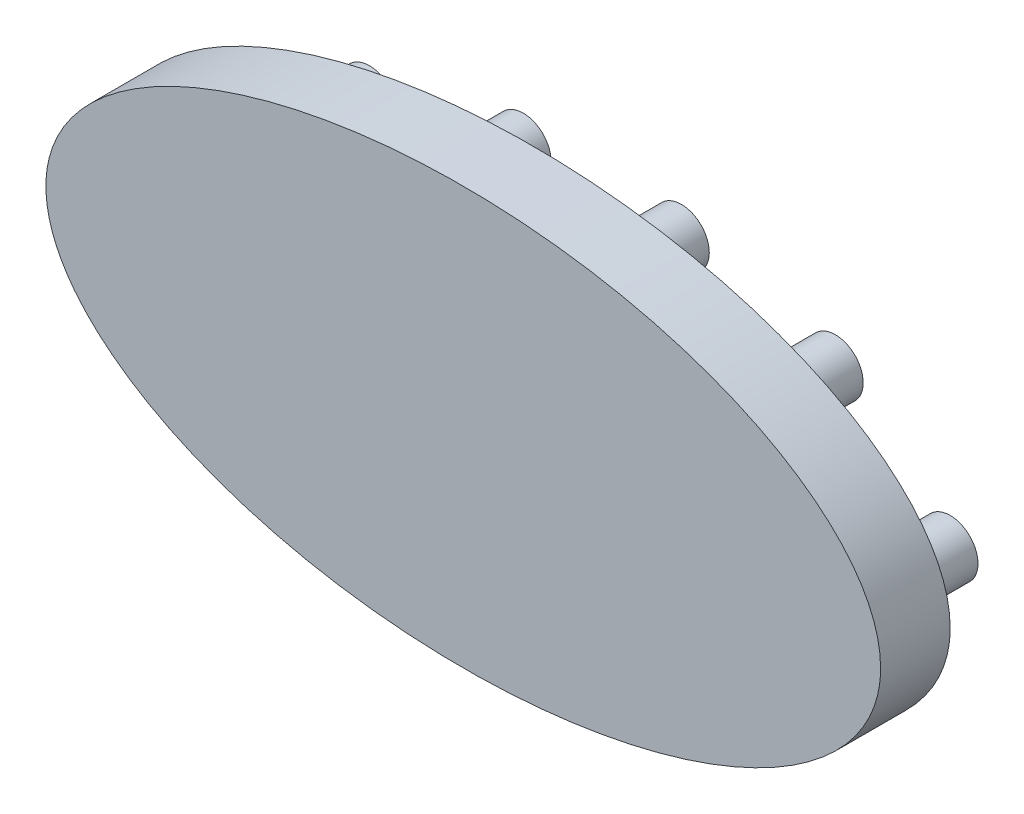
ISO-10303-21;
HEADER;
FILE_DESCRIPTION(('STEP AP214'),'2;1');
FILE_NAME('part.step','',(''),(''),'','','');
FILE_SCHEMA(('AUTOMOTIVE_DESIGN { 1 0 10303 214 1 1 1 1 }'));
ENDSEC;
DATA;
#1=APPLICATION_CONTEXT('core data for automotive mechanical design processes');
#2=APPLICATION_PROTOCOL_DEFINITION('international standard','automotive_design',2000,#1);
#3=PRODUCT_CONTEXT('',#1,'mechanical');
#4=PRODUCT('Part','Part','',(#3));
#5=PRODUCT_RELATED_PRODUCT_CATEGORY('part','',(#4));
#6=PRODUCT_DEFINITION_FORMATION('','',#4);
#7=PRODUCT_DEFINITION_CONTEXT('part definition',#1,'design');
#8=PRODUCT_DEFINITION('design','',#6,#7);
#9=PRODUCT_DEFINITION_SHAPE('','',#8);
#10=(LENGTH_UNIT() NAMED_UNIT(*) SI_UNIT(.MILLI.,.METRE.));
#11=(NAMED_UNIT(*) PLANE_ANGLE_UNIT() SI_UNIT($,.RADIAN.));
#12=(NAMED_UNIT(*) SI_UNIT($,.STERADIAN.) SOLID_ANGLE_UNIT());
#13=UNCERTAINTY_MEASURE_WITH_UNIT(LENGTH_MEASURE(1.E-05),#10,'distance_accuracy_value','');
#14=(GEOMETRIC_REPRESENTATION_CONTEXT(3) GLOBAL_UNCERTAINTY_ASSIGNED_CONTEXT((#13)) GLOBAL_UNIT_ASSIGNED_CONTEXT((#10,
#11,#12)) REPRESENTATION_CONTEXT('',''));
#15=CARTESIAN_POINT('',(0.,0.,0.));
#16=DIRECTION('',(0.,0.,1.));
#17=DIRECTION('',(1.,0.,0.));
#18=AXIS2_PLACEMENT_3D('',#15,#16,#17);
#19=CARTESIAN_POINT('',(0.,0.,10.));
#20=DIRECTION('',(0.,0.,1.));
#21=DIRECTION('',(1.,0.,0.));
#22=AXIS2_PLACEMENT_3D('',#19,#20,#21);
#23=ELLIPSE('',#22,60.,30.);
#24=DIRECTION('',(0.,0.,-1.));
#25=VECTOR('',#24,1.);
#26=SURFACE_OF_LINEAR_EXTRUSION('',#23,#25);
#27=CARTESIAN_POINT('',(60.,0.,10.));
#28=VERTEX_POINT('',#27);
#29=EDGE_CURVE('E10',#28,#28,#23,.T.);
#30=ORIENTED_EDGE('',*,*,#29,.F.);
#31=EDGE_LOOP('',(#30));
#32=FACE_BOUND('',#31,.T.);
#33=CARTESIAN_POINT('',(0.,0.,0.));
#34=DIRECTION('',(0.,0.,1.));
#35=DIRECTION('',(1.,0.,0.));
#36=AXIS2_PLACEMENT_3D('',#33,#34,#35);
#37=ELLIPSE('',#36,60.,30.);
#38=CARTESIAN_POINT('',(60.,0.,0.));
#39=VERTEX_POINT('',#38);
#40=EDGE_CURVE('E37',#39,#39,#37,.T.);
#41=ORIENTED_EDGE('',*,*,#40,.T.);
#42=EDGE_LOOP('',(#41));
#43=FACE_BOUND('',#42,.T.);
#44=ADVANCED_FACE('F33',(#32,#43),#26,.F.);
#45=CARTESIAN_POINT('',(0.,0.,10.));
#46=DIRECTION('',(0.,0.,1.));
#47=DIRECTION('',(1.,0.,0.));
#48=AXIS2_PLACEMENT_3D('',#45,#46,#47);
#49=PLANE('',#48);
#50=ORIENTED_EDGE('',*,*,#29,.T.);
#51=EDGE_LOOP('',(#50));
#52=FACE_BOUND('',#51,.T.);
#53=ADVANCED_FACE('F118',(#52),#49,.T.);
#54=CARTESIAN_POINT('',(0.,0.,0.));
#55=DIRECTION('',(0.,0.,1.));
#56=DIRECTION('',(1.,0.,0.));
#57=AXIS2_PLACEMENT_3D('',#54,#55,#56);
#58=PLANE('',#57);
#59=CARTESIAN_POINT('',(-33.4927376913771,-14.2505559737356,0.));
#60=DIRECTION('',(0.,0.,1.));
#61=DIRECTION('',(1.,0.,0.));
#62=AXIS2_PLACEMENT_3D('',#59,#60,#61);
#63=CIRCLE('',#62,4.00000000000001);
#64=CARTESIAN_POINT('',(-29.4927376913771,-14.2505559737356,0.));
#65=VERTEX_POINT('',#64);
#66=EDGE_CURVE('E100',#65,#65,#63,.T.);
#67=ORIENTED_EDGE('',*,*,#66,.T.);
#68=EDGE_LOOP('',(#67));
#69=FACE_BOUND('',#68,.T.);
#70=CARTESIAN_POINT('',(-11.3707510585485,-19.4054964723432,0.));
#71=DIRECTION('',(0.,0.,1.));
#72=DIRECTION('',(1.,0.,0.));
#73=AXIS2_PLACEMENT_3D('',#70,#71,#72);
#74=CIRCLE('',#73,4.00000000000001);
#75=CARTESIAN_POINT('',(-7.37075105854853,-19.4054964723432,0.));
#76=VERTEX_POINT('',#75);
#77=EDGE_CURVE('E94',#76,#76,#74,.T.);
#78=ORIENTED_EDGE('',*,*,#77,.T.);
#79=EDGE_LOOP('',(#78));
#80=FACE_BOUND('',#79,.T.);
#81=CARTESIAN_POINT('',(11.3694778656819,-19.4056340544413,0.));
#82=DIRECTION('',(0.,0.,1.));
#83=DIRECTION('',(1.,0.,0.));
#84=AXIS2_PLACEMENT_3D('',#81,#82,#83);
#85=CIRCLE('',#84,4.00000000000001);
#86=CARTESIAN_POINT('',(15.3694778656819,-19.4056340544413,0.));
#87=VERTEX_POINT('',#86);
#88=EDGE_CURVE('E88',#87,#87,#85,.T.);
#89=ORIENTED_EDGE('',*,*,#88,.T.);
#90=EDGE_LOOP('',(#89));
#91=FACE_BOUND('',#90,.T.);
#92=CARTESIAN_POINT('',(33.4930624288127,-14.2504076731819,0.));
#93=DIRECTION('',(0.,0.,1.));
#94=DIRECTION('',(1.,0.,0.));
#95=AXIS2_PLACEMENT_3D('',#92,#93,#94);
#96=CIRCLE('',#95,4.00000000000001);
#97=CARTESIAN_POINT('',(37.4930624288127,-14.2504076731819,0.));
#98=VERTEX_POINT('',#97);
#99=EDGE_CURVE('E82',#98,#98,#96,.T.);
#100=ORIENTED_EDGE('',*,*,#99,.T.);
#101=EDGE_LOOP('',(#100));
#102=FACE_BOUND('',#101,.T.);
#103=CARTESIAN_POINT('',(49.9998278346197,-8.01509218299913E-05,0.));
#104=DIRECTION('',(0.,0.,1.));
#105=DIRECTION('',(1.,0.,0.));
#106=AXIS2_PLACEMENT_3D('',#103,#104,#105);
#107=CIRCLE('',#106,4.00000000000001);
#108=CARTESIAN_POINT('',(53.9998278346197,-8.01509218299913E-05,0.));
#109=VERTEX_POINT('',#108);
#110=EDGE_CURVE('E76',#109,#109,#107,.T.);
#111=ORIENTED_EDGE('',*,*,#110,.T.);
#112=EDGE_LOOP('',(#111));
#113=FACE_BOUND('',#112,.T.);
#114=CARTESIAN_POINT('',(33.4933729430165,14.2504031084241,0.));
#115=DIRECTION('',(0.,0.,1.));
#116=DIRECTION('',(1.,0.,0.));
#117=AXIS2_PLACEMENT_3D('',#114,#115,#116);
#118=CIRCLE('',#117,4.00000000000001);
#119=CARTESIAN_POINT('',(37.4933729430165,14.2504031084241,0.));
#120=VERTEX_POINT('',#119);
#121=EDGE_CURVE('E70',#120,#120,#118,.T.);
#122=ORIENTED_EDGE('',*,*,#121,.T.);
#123=EDGE_LOOP('',(#122));
#124=FACE_BOUND('',#123,.T.);
#125=CARTESIAN_POINT('',(11.3704332672726,19.4055249455261,0.));
#126=DIRECTION('',(0.,0.,1.));
#127=DIRECTION('',(1.,0.,0.));
#128=AXIS2_PLACEMENT_3D('',#125,#126,#127);
#129=CIRCLE('',#128,4.00000000000001);
#130=CARTESIAN_POINT('',(15.3704332672726,19.4055249455261,0.));
#131=VERTEX_POINT('',#130);
#132=EDGE_CURVE('E64',#131,#131,#129,.T.);
#133=ORIENTED_EDGE('',*,*,#132,.T.);
#134=EDGE_LOOP('',(#133));
#135=FACE_BOUND('',#134,.T.);
#136=CARTESIAN_POINT('',(-11.3709220577197,19.4054787370214,0.));
#137=DIRECTION('',(0.,0.,1.));
#138=DIRECTION('',(1.,0.,0.));
#139=AXIS2_PLACEMENT_3D('',#136,#137,#138);
#140=CIRCLE('',#139,4.00000000000001);
#141=CARTESIAN_POINT('',(-7.37092205771973,19.4054787370214,0.));
#142=VERTEX_POINT('',#141);
#143=EDGE_CURVE('E58',#142,#142,#140,.T.);
#144=ORIENTED_EDGE('',*,*,#143,.T.);
#145=EDGE_LOOP('',(#144));
#146=FACE_BOUND('',#145,.T.);
#147=CARTESIAN_POINT('',(-33.4928390229977,14.2505418810529,0.));
#148=DIRECTION('',(0.,0.,1.));
#149=DIRECTION('',(1.,0.,0.));
#150=AXIS2_PLACEMENT_3D('',#147,#148,#149);
#151=CIRCLE('',#150,4.00000000000001);
#152=CARTESIAN_POINT('',(-29.4928390229977,14.2505418810529,0.));
#153=VERTEX_POINT('',#152);
#154=EDGE_CURVE('E52',#153,#153,#151,.T.);
#155=ORIENTED_EDGE('',*,*,#154,.T.);
#156=EDGE_LOOP('',(#155));
#157=FACE_BOUND('',#156,.T.);
#158=CARTESIAN_POINT('',(-50.,0.,0.));
#159=DIRECTION('',(0.,0.,1.));
#160=DIRECTION('',(1.,0.,0.));
#161=AXIS2_PLACEMENT_3D('',#158,#159,#160);
#162=CIRCLE('',#161,4.00000000000001);
#163=CARTESIAN_POINT('',(-46.,0.,0.));
#164=VERTEX_POINT('',#163);
#165=EDGE_CURVE('E46',#164,#164,#162,.T.);
#166=ORIENTED_EDGE('',*,*,#165,.T.);
#167=EDGE_LOOP('',(#166));
#168=FACE_BOUND('',#167,.T.);
#169=ORIENTED_EDGE('',*,*,#40,.F.);
#170=EDGE_LOOP('',(#169));
#171=FACE_BOUND('',#170,.T.);
#172=ADVANCED_FACE('F123',(#69,#80,#91,#102,#113,#124,#135,#146,#157,#168,#171),#58,.F.);
#173=CARTESIAN_POINT('',(-50.,0.,-10.));
#174=DIRECTION('',(0.,0.,1.));
#175=DIRECTION('',(1.,0.,0.));
#176=AXIS2_PLACEMENT_3D('',#173,#174,#175);
#177=CYLINDRICAL_SURFACE('',#176,4.00000000000001);
#178=CARTESIAN_POINT('',(-50.,0.,-10.));
#179=DIRECTION('',(0.,0.,1.));
#180=DIRECTION('',(1.,0.,0.));
#181=AXIS2_PLACEMENT_3D('',#178,#179,#180);
#182=CIRCLE('',#181,4.00000000000001);
#183=CARTESIAN_POINT('',(-46.,0.,-10.));
#184=VERTEX_POINT('',#183);
#185=EDGE_CURVE('E43',#184,#184,#182,.T.);
#186=ORIENTED_EDGE('',*,*,#185,.T.);
#187=EDGE_LOOP('',(#186));
#188=FACE_BOUND('',#187,.T.);
#189=ORIENTED_EDGE('',*,*,#165,.F.);
#190=EDGE_LOOP('',(#189));
#191=FACE_BOUND('',#190,.T.);
#192=ADVANCED_FACE('F129',(#188,#191),#177,.T.);
#193=CARTESIAN_POINT('',(0.,0.,-10.));
#194=DIRECTION('',(0.,0.,1.));
#195=DIRECTION('',(1.,0.,0.));
#196=AXIS2_PLACEMENT_3D('',#193,#194,#195);
#197=PLANE('',#196);
#198=ORIENTED_EDGE('',*,*,#185,.F.);
#199=EDGE_LOOP('',(#198));
#200=FACE_BOUND('',#199,.T.);
#201=ADVANCED_FACE('F134',(#200),#197,.F.);
#202=CARTESIAN_POINT('',(-33.4928390229977,14.2505418810529,-10.));
#203=DIRECTION('',(0.,0.,1.));
#204=DIRECTION('',(1.,0.,0.));
#205=AXIS2_PLACEMENT_3D('',#202,#203,#204);
#206=CYLINDRICAL_SURFACE('',#205,4.00000000000001);
#207=CARTESIAN_POINT('',(-33.4928390229977,14.2505418810529,-10.));
#208=DIRECTION('',(0.,0.,1.));
#209=DIRECTION('',(1.,0.,0.));
#210=AXIS2_PLACEMENT_3D('',#207,#208,#209);
#211=CIRCLE('',#210,4.00000000000001);
#212=CARTESIAN_POINT('',(-29.4928390229977,14.2505418810529,-10.));
#213=VERTEX_POINT('',#212);
#214=EDGE_CURVE('E49',#213,#213,#211,.T.);
#215=ORIENTED_EDGE('',*,*,#214,.T.);
#216=EDGE_LOOP('',(#215));
#217=FACE_BOUND('',#216,.T.);
#218=ORIENTED_EDGE('',*,*,#154,.F.);
#219=EDGE_LOOP('',(#218));
#220=FACE_BOUND('',#219,.T.);
#221=ADVANCED_FACE('F141',(#217,#220),#206,.T.);
#222=CARTESIAN_POINT('',(16.5071609770023,14.2505418810529,-10.));
#223=DIRECTION('',(0.,0.,1.));
#224=DIRECTION('',(1.,0.,0.));
#225=AXIS2_PLACEMENT_3D('',#222,#223,#224);
#226=PLANE('',#225);
#227=ORIENTED_EDGE('',*,*,#214,.F.);
#228=EDGE_LOOP('',(#227));
#229=FACE_BOUND('',#228,.T.);
#230=ADVANCED_FACE('F145',(#229),#226,.F.);
#231=CARTESIAN_POINT('',(-11.3709220577197,19.4054787370214,-10.));
#232=DIRECTION('',(0.,0.,1.));
#233=DIRECTION('',(1.,0.,0.));
#234=AXIS2_PLACEMENT_3D('',#231,#232,#233);
#235=CYLINDRICAL_SURFACE('',#234,4.00000000000001);
#236=CARTESIAN_POINT('',(-11.3709220577197,19.4054787370214,-10.));
#237=DIRECTION('',(0.,0.,1.));
#238=DIRECTION('',(1.,0.,0.));
#239=AXIS2_PLACEMENT_3D('',#236,#237,#238);
#240=CIRCLE('',#239,4.00000000000001);
#241=CARTESIAN_POINT('',(-7.37092205771973,19.4054787370214,-10.));
#242=VERTEX_POINT('',#241);
#243=EDGE_CURVE('E55',#242,#242,#240,.T.);
#244=ORIENTED_EDGE('',*,*,#243,.T.);
#245=EDGE_LOOP('',(#244));
#246=FACE_BOUND('',#245,.T.);
#247=ORIENTED_EDGE('',*,*,#143,.F.);
#248=EDGE_LOOP('',(#247));
#249=FACE_BOUND('',#248,.T.);
#250=ADVANCED_FACE('F149',(#246,#249),#235,.T.);
#251=CARTESIAN_POINT('',(38.6290779422803,19.4054787370214,-10.));
#252=DIRECTION('',(0.,0.,1.));
#253=DIRECTION('',(1.,0.,0.));
#254=AXIS2_PLACEMENT_3D('',#251,#252,#253);
#255=PLANE('',#254);
#256=ORIENTED_EDGE('',*,*,#243,.F.);
#257=EDGE_LOOP('',(#256));
#258=FACE_BOUND('',#257,.T.);
#259=ADVANCED_FACE('F153',(#258),#255,.F.);
#260=CARTESIAN_POINT('',(11.3704332672726,19.4055249455261,-10.));
#261=DIRECTION('',(0.,0.,1.));
#262=DIRECTION('',(1.,0.,0.));
#263=AXIS2_PLACEMENT_3D('',#260,#261,#262);
#264=CYLINDRICAL_SURFACE('',#263,4.00000000000001);
#265=CARTESIAN_POINT('',(11.3704332672726,19.4055249455261,-10.));
#266=DIRECTION('',(0.,0.,1.));
#267=DIRECTION('',(1.,0.,0.));
#268=AXIS2_PLACEMENT_3D('',#265,#266,#267);
#269=CIRCLE('',#268,4.00000000000001);
#270=CARTESIAN_POINT('',(15.3704332672726,19.4055249455261,-10.));
#271=VERTEX_POINT('',#270);
#272=EDGE_CURVE('E61',#271,#271,#269,.T.);
#273=ORIENTED_EDGE('',*,*,#272,.T.);
#274=EDGE_LOOP('',(#273));
#275=FACE_BOUND('',#274,.T.);
#276=ORIENTED_EDGE('',*,*,#132,.F.);
#277=EDGE_LOOP('',(#276));
#278=FACE_BOUND('',#277,.T.);
#279=ADVANCED_FACE('F157',(#275,#278),#264,.T.);
#280=CARTESIAN_POINT('',(61.3704332672726,19.4055249455261,-10.));
#281=DIRECTION('',(0.,0.,1.));
#282=DIRECTION('',(1.,0.,0.));
#283=AXIS2_PLACEMENT_3D('',#280,#281,#282);
#284=PLANE('',#283);
#285=ORIENTED_EDGE('',*,*,#272,.F.);
#286=EDGE_LOOP('',(#285));
#287=FACE_BOUND('',#286,.T.);
#288=ADVANCED_FACE('F161',(#287),#284,.F.);
#289=CARTESIAN_POINT('',(33.4933729430165,14.2504031084241,-10.));
#290=DIRECTION('',(0.,0.,1.));
#291=DIRECTION('',(1.,0.,0.));
#292=AXIS2_PLACEMENT_3D('',#289,#290,#291);
#293=CYLINDRICAL_SURFACE('',#292,4.00000000000001);
#294=CARTESIAN_POINT('',(33.4933729430165,14.2504031084241,-10.));
#295=DIRECTION('',(0.,0.,1.));
#296=DIRECTION('',(1.,0.,0.));
#297=AXIS2_PLACEMENT_3D('',#294,#295,#296);
#298=CIRCLE('',#297,4.00000000000001);
#299=CARTESIAN_POINT('',(37.4933729430165,14.2504031084241,-10.));
#300=VERTEX_POINT('',#299);
#301=EDGE_CURVE('E67',#300,#300,#298,.T.);
#302=ORIENTED_EDGE('',*,*,#301,.T.);
#303=EDGE_LOOP('',(#302));
#304=FACE_BOUND('',#303,.T.);
#305=ORIENTED_EDGE('',*,*,#121,.F.);
#306=EDGE_LOOP('',(#305));
#307=FACE_BOUND('',#306,.T.);
#308=ADVANCED_FACE('F165',(#304,#307),#293,.T.);
#309=CARTESIAN_POINT('',(83.4933729430165,14.2504031084241,-10.));
#310=DIRECTION('',(0.,0.,1.));
#311=DIRECTION('',(1.,0.,0.));
#312=AXIS2_PLACEMENT_3D('',#309,#310,#311);
#313=PLANE('',#312);
#314=ORIENTED_EDGE('',*,*,#301,.F.);
#315=EDGE_LOOP('',(#314));
#316=FACE_BOUND('',#315,.T.);
#317=ADVANCED_FACE('F169',(#316),#313,.F.);
#318=CARTESIAN_POINT('',(49.9998278346197,-8.01509218299913E-05,-10.));
#319=DIRECTION('',(0.,0.,1.));
#320=DIRECTION('',(1.,0.,0.));
#321=AXIS2_PLACEMENT_3D('',#318,#319,#320);
#322=CYLINDRICAL_SURFACE('',#321,4.00000000000001);
#323=CARTESIAN_POINT('',(49.9998278346197,-8.01509218299913E-05,-10.));
#324=DIRECTION('',(0.,0.,1.));
#325=DIRECTION('',(1.,0.,0.));
#326=AXIS2_PLACEMENT_3D('',#323,#324,#325);
#327=CIRCLE('',#326,4.00000000000001);
#328=CARTESIAN_POINT('',(53.9998278346197,-8.01509218299913E-05,-10.));
#329=VERTEX_POINT('',#328);
#330=EDGE_CURVE('E73',#329,#329,#327,.T.);
#331=ORIENTED_EDGE('',*,*,#330,.T.);
#332=EDGE_LOOP('',(#331));
#333=FACE_BOUND('',#332,.T.);
#334=ORIENTED_EDGE('',*,*,#110,.F.);
#335=EDGE_LOOP('',(#334));
#336=FACE_BOUND('',#335,.T.);
#337=ADVANCED_FACE('F173',(#333,#336),#322,.T.);
#338=CARTESIAN_POINT('',(99.9998278346197,-8.01509218299913E-05,-10.));
#339=DIRECTION('',(0.,0.,1.));
#340=DIRECTION('',(1.,0.,0.));
#341=AXIS2_PLACEMENT_3D('',#338,#339,#340);
#342=PLANE('',#341);
#343=ORIENTED_EDGE('',*,*,#330,.F.);
#344=EDGE_LOOP('',(#343));
#345=FACE_BOUND('',#344,.T.);
#346=ADVANCED_FACE('F177',(#345),#342,.F.);
#347=CARTESIAN_POINT('',(33.4930624288127,-14.2504076731819,-10.));
#348=DIRECTION('',(0.,0.,1.));
#349=DIRECTION('',(1.,0.,0.));
#350=AXIS2_PLACEMENT_3D('',#347,#348,#349);
#351=CYLINDRICAL_SURFACE('',#350,4.00000000000001);
#352=CARTESIAN_POINT('',(33.4930624288127,-14.2504076731819,-10.));
#353=DIRECTION('',(0.,0.,1.));
#354=DIRECTION('',(1.,0.,0.));
#355=AXIS2_PLACEMENT_3D('',#352,#353,#354);
#356=CIRCLE('',#355,4.00000000000001);
#357=CARTESIAN_POINT('',(37.4930624288127,-14.2504076731819,-10.));
#358=VERTEX_POINT('',#357);
#359=EDGE_CURVE('E79',#358,#358,#356,.T.);
#360=ORIENTED_EDGE('',*,*,#359,.T.);
#361=EDGE_LOOP('',(#360));
#362=FACE_BOUND('',#361,.T.);
#363=ORIENTED_EDGE('',*,*,#99,.F.);
#364=EDGE_LOOP('',(#363));
#365=FACE_BOUND('',#364,.T.);
#366=ADVANCED_FACE('F181',(#362,#365),#351,.T.);
#367=CARTESIAN_POINT('',(83.4930624288127,-14.2504076731819,-10.));
#368=DIRECTION('',(0.,0.,1.));
#369=DIRECTION('',(1.,0.,0.));
#370=AXIS2_PLACEMENT_3D('',#367,#368,#369);
#371=PLANE('',#370);
#372=ORIENTED_EDGE('',*,*,#359,.F.);
#373=EDGE_LOOP('',(#372));
#374=FACE_BOUND('',#373,.T.);
#375=ADVANCED_FACE('F185',(#374),#371,.F.);
#376=CARTESIAN_POINT('',(11.3694778656819,-19.4056340544413,-10.));
#377=DIRECTION('',(0.,0.,1.));
#378=DIRECTION('',(1.,0.,0.));
#379=AXIS2_PLACEMENT_3D('',#376,#377,#378);
#380=CYLINDRICAL_SURFACE('',#379,4.00000000000001);
#381=CARTESIAN_POINT('',(11.3694778656819,-19.4056340544413,-10.));
#382=DIRECTION('',(0.,0.,1.));
#383=DIRECTION('',(1.,0.,0.));
#384=AXIS2_PLACEMENT_3D('',#381,#382,#383);
#385=CIRCLE('',#384,4.00000000000001);
#386=CARTESIAN_POINT('',(15.3694778656819,-19.4056340544413,-10.));
#387=VERTEX_POINT('',#386);
#388=EDGE_CURVE('E85',#387,#387,#385,.T.);
#389=ORIENTED_EDGE('',*,*,#388,.T.);
#390=EDGE_LOOP('',(#389));
#391=FACE_BOUND('',#390,.T.);
#392=ORIENTED_EDGE('',*,*,#88,.F.);
#393=EDGE_LOOP('',(#392));
#394=FACE_BOUND('',#393,.T.);
#395=ADVANCED_FACE('F189',(#391,#394),#380,.T.);
#396=CARTESIAN_POINT('',(61.3694778656819,-19.4056340544413,-10.));
#397=DIRECTION('',(0.,0.,1.));
#398=DIRECTION('',(1.,0.,0.));
#399=AXIS2_PLACEMENT_3D('',#396,#397,#398);
#400=PLANE('',#399);
#401=ORIENTED_EDGE('',*,*,#388,.F.);
#402=EDGE_LOOP('',(#401));
#403=FACE_BOUND('',#402,.T.);
#404=ADVANCED_FACE('F193',(#403),#400,.F.);
#405=CARTESIAN_POINT('',(-11.3707510585485,-19.4054964723432,-10.));
#406=DIRECTION('',(0.,0.,1.));
#407=DIRECTION('',(1.,0.,0.));
#408=AXIS2_PLACEMENT_3D('',#405,#406,#407);
#409=CYLINDRICAL_SURFACE('',#408,4.00000000000001);
#410=CARTESIAN_POINT('',(-11.3707510585485,-19.4054964723432,-10.));
#411=DIRECTION('',(0.,0.,1.));
#412=DIRECTION('',(1.,0.,0.));
#413=AXIS2_PLACEMENT_3D('',#410,#411,#412);
#414=CIRCLE('',#413,4.00000000000001);
#415=CARTESIAN_POINT('',(-7.37075105854853,-19.4054964723432,-10.));
#416=VERTEX_POINT('',#415);
#417=EDGE_CURVE('E91',#416,#416,#414,.T.);
#418=ORIENTED_EDGE('',*,*,#417,.T.);
#419=EDGE_LOOP('',(#418));
#420=FACE_BOUND('',#419,.T.);
#421=ORIENTED_EDGE('',*,*,#77,.F.);
#422=EDGE_LOOP('',(#421));
#423=FACE_BOUND('',#422,.T.);
#424=ADVANCED_FACE('F197',(#420,#423),#409,.T.);
#425=CARTESIAN_POINT('',(38.6292489414515,-19.4054964723432,-10.));
#426=DIRECTION('',(0.,0.,1.));
#427=DIRECTION('',(1.,0.,0.));
#428=AXIS2_PLACEMENT_3D('',#425,#426,#427);
#429=PLANE('',#428);
#430=ORIENTED_EDGE('',*,*,#417,.F.);
#431=EDGE_LOOP('',(#430));
#432=FACE_BOUND('',#431,.T.);
#433=ADVANCED_FACE('F115',(#432),#429,.F.);
#434=CARTESIAN_POINT('',(-33.4927376913771,-14.2505559737356,-10.));
#435=DIRECTION('',(0.,0.,1.));
#436=DIRECTION('',(1.,0.,0.));
#437=AXIS2_PLACEMENT_3D('',#434,#435,#436);
#438=CYLINDRICAL_SURFACE('',#437,4.00000000000001);
#439=CARTESIAN_POINT('',(-33.4927376913771,-14.2505559737356,-10.));
#440=DIRECTION('',(0.,0.,1.));
#441=DIRECTION('',(1.,0.,0.));
#442=AXIS2_PLACEMENT_3D('',#439,#440,#441);
#443=CIRCLE('',#442,4.00000000000001);
#444=CARTESIAN_POINT('',(-29.4927376913771,-14.2505559737356,-10.));
#445=VERTEX_POINT('',#444);
#446=EDGE_CURVE('E97',#445,#445,#443,.T.);
#447=ORIENTED_EDGE('',*,*,#446,.T.);
#448=EDGE_LOOP('',(#447));
#449=FACE_BOUND('',#448,.T.);
#450=ORIENTED_EDGE('',*,*,#66,.F.);
#451=EDGE_LOOP('',(#450));
#452=FACE_BOUND('',#451,.T.);
#453=ADVANCED_FACE('F106',(#449,#452),#438,.T.);
#454=CARTESIAN_POINT('',(16.5072623086229,-14.2505559737356,-10.));
#455=DIRECTION('',(0.,0.,1.));
#456=DIRECTION('',(1.,0.,0.));
#457=AXIS2_PLACEMENT_3D('',#454,#455,#456);
#458=PLANE('',#457);
#459=ORIENTED_EDGE('',*,*,#446,.F.);
#460=EDGE_LOOP('',(#459));
#461=FACE_BOUND('',#460,.T.);
#462=ADVANCED_FACE('F109',(#461),#458,.F.);
#463=CLOSED_SHELL('',(#44,#53,#172,#192,#201,#221,#230,#250,#259,#279,#288,#308,#317,#337,#346,
#366,#375,#395,#404,#424,#433,#453,#462));
#464=MANIFOLD_SOLID_BREP('B2',#463);
#465=ADVANCED_BREP_SHAPE_REPRESENTATION('',(#18,#464),#14);
#466=SHAPE_DEFINITION_REPRESENTATION(#9,#465);
ENDSEC;
END-ISO-10303-21;
